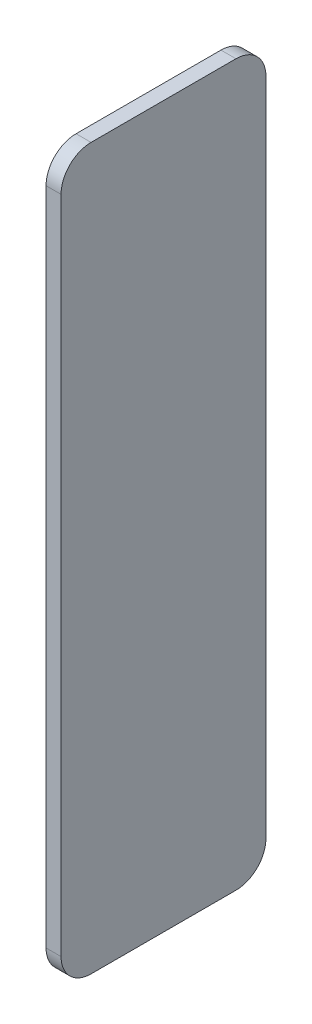
ISO-10303-21;
HEADER;
FILE_DESCRIPTION(('STEP AP214'),'2;1');
FILE_NAME('part.step','',(''),(''),'','','');
FILE_SCHEMA(('AUTOMOTIVE_DESIGN { 1 0 10303 214 1 1 1 1 }'));
ENDSEC;
DATA;
#1=APPLICATION_CONTEXT('core data for automotive mechanical design processes');
#2=APPLICATION_PROTOCOL_DEFINITION('international standard','automotive_design',2000,#1);
#3=PRODUCT_CONTEXT('',#1,'mechanical');
#4=PRODUCT('Part','Part','',(#3));
#5=PRODUCT_RELATED_PRODUCT_CATEGORY('part','',(#4));
#6=PRODUCT_DEFINITION_FORMATION('','',#4);
#7=PRODUCT_DEFINITION_CONTEXT('part definition',#1,'design');
#8=PRODUCT_DEFINITION('design','',#6,#7);
#9=PRODUCT_DEFINITION_SHAPE('','',#8);
#10=(LENGTH_UNIT() NAMED_UNIT(*) SI_UNIT(.MILLI.,.METRE.));
#11=(NAMED_UNIT(*) PLANE_ANGLE_UNIT() SI_UNIT($,.RADIAN.));
#12=(NAMED_UNIT(*) SI_UNIT($,.STERADIAN.) SOLID_ANGLE_UNIT());
#13=UNCERTAINTY_MEASURE_WITH_UNIT(LENGTH_MEASURE(1.E-05),#10,'distance_accuracy_value','');
#14=(GEOMETRIC_REPRESENTATION_CONTEXT(3) GLOBAL_UNCERTAINTY_ASSIGNED_CONTEXT((#13)) GLOBAL_UNIT_ASSIGNED_CONTEXT((#10,
#11,#12)) REPRESENTATION_CONTEXT('',''));
#15=CARTESIAN_POINT('',(0.,0.,0.));
#16=DIRECTION('',(0.,0.,1.));
#17=DIRECTION('',(1.,0.,0.));
#18=AXIS2_PLACEMENT_3D('',#15,#16,#17);
#19=CARTESIAN_POINT('',(-186.482668327185,108.771242076215,-91.0240564259798));
#20=DIRECTION('',(0.,0.,-1.));
#21=DIRECTION('',(-1.,0.,0.));
#22=AXIS2_PLACEMENT_3D('',#19,#20,#21);
#23=PLANE('',#22);
#24=DIRECTION('',(0.,-1.,0.));
#25=VECTOR('',#24,1.);
#26=CARTESIAN_POINT('',(-186.482668327185,108.771242076215,-91.0240564259798));
#27=LINE('',#26,#25);
#28=CARTESIAN_POINT('',(-186.482668327185,98.7712420762154,-91.0240564259798));
#29=VERTEX_POINT('',#28);
#30=CARTESIAN_POINT('',(-186.482668327185,-121.228757923785,-91.0240564259798));
#31=VERTEX_POINT('',#30);
#32=EDGE_CURVE('E157',#29,#31,#27,.T.);
#33=ORIENTED_EDGE('',*,*,#32,.T.);
#34=DIRECTION('',(-1.,0.,0.));
#35=VECTOR('',#34,1.);
#36=CARTESIAN_POINT('',(-186.482668327185,-121.228757923785,-91.0240564259798));
#37=LINE('',#36,#35);
#38=CARTESIAN_POINT('',(-191.482668327185,-121.228757923785,-91.0240564259798));
#39=VERTEX_POINT('',#38);
#40=EDGE_CURVE('E150',#31,#39,#37,.T.);
#41=ORIENTED_EDGE('',*,*,#40,.T.);
#42=DIRECTION('',(0.,-1.,0.));
#43=VECTOR('',#42,1.);
#44=CARTESIAN_POINT('',(-191.482668327185,108.771242076215,-91.0240564259798));
#45=LINE('',#44,#43);
#46=CARTESIAN_POINT('',(-191.482668327185,98.7712420762154,-91.0240564259798));
#47=VERTEX_POINT('',#46);
#48=EDGE_CURVE('E103',#47,#39,#45,.T.);
#49=ORIENTED_EDGE('',*,*,#48,.F.);
#50=DIRECTION('',(-1.,0.,0.));
#51=VECTOR('',#50,1.);
#52=CARTESIAN_POINT('',(-186.482668327185,98.7712420762154,-91.0240564259798));
#53=LINE('',#52,#51);
#54=EDGE_CURVE('E148',#47,#29,#53,.F.);
#55=ORIENTED_EDGE('',*,*,#54,.T.);
#56=EDGE_LOOP('',(#33,#41,#49,#55));
#57=FACE_BOUND('',#56,.T.);
#58=ADVANCED_FACE('F33',(#57),#23,.T.);
#59=CARTESIAN_POINT('',(-186.482668327185,108.771242076215,-91.0240564259798));
#60=DIRECTION('',(0.,1.,0.));
#61=DIRECTION('',(0.,0.,1.));
#62=AXIS2_PLACEMENT_3D('',#59,#60,#61);
#63=PLANE('',#62);
#64=DIRECTION('',(0.,0.,-1.));
#65=VECTOR('',#64,1.);
#66=CARTESIAN_POINT('',(-191.482668327185,108.771242076215,-91.0240564259798));
#67=LINE('',#66,#65);
#68=CARTESIAN_POINT('',(-191.482668327185,108.771242076215,-32.7384996739401));
#69=VERTEX_POINT('',#68);
#70=CARTESIAN_POINT('',(-191.482668327185,108.771242076215,-81.0240564259798));
#71=VERTEX_POINT('',#70);
#72=EDGE_CURVE('E131',#69,#71,#67,.T.);
#73=ORIENTED_EDGE('',*,*,#72,.F.);
#74=DIRECTION('',(-1.,0.,0.));
#75=VECTOR('',#74,1.);
#76=CARTESIAN_POINT('',(-186.482668327185,108.771242076215,-32.7384996739401));
#77=LINE('',#76,#75);
#78=CARTESIAN_POINT('',(-186.482668327185,108.771242076215,-32.7384996739401));
#79=VERTEX_POINT('',#78);
#80=EDGE_CURVE('E11',#69,#79,#77,.F.);
#81=ORIENTED_EDGE('',*,*,#80,.T.);
#82=DIRECTION('',(0.,0.,-1.));
#83=VECTOR('',#82,1.);
#84=CARTESIAN_POINT('',(-186.482668327185,108.771242076215,-91.0240564259798));
#85=LINE('',#84,#83);
#86=CARTESIAN_POINT('',(-186.482668327185,108.771242076215,-81.0240564259798));
#87=VERTEX_POINT('',#86);
#88=EDGE_CURVE('E124',#79,#87,#85,.T.);
#89=ORIENTED_EDGE('',*,*,#88,.T.);
#90=DIRECTION('',(-1.,0.,0.));
#91=VECTOR('',#90,1.);
#92=CARTESIAN_POINT('',(-186.482668327185,108.771242076215,-81.0240564259798));
#93=LINE('',#92,#91);
#94=EDGE_CURVE('E41',#87,#71,#93,.T.);
#95=ORIENTED_EDGE('',*,*,#94,.T.);
#96=EDGE_LOOP('',(#73,#81,#89,#95));
#97=FACE_BOUND('',#96,.T.);
#98=ADVANCED_FACE('F154',(#97),#63,.T.);
#99=CARTESIAN_POINT('',(-186.482668327185,108.771242076215,-22.7384996739401));
#100=DIRECTION('',(0.,0.,1.));
#101=DIRECTION('',(1.,0.,0.));
#102=AXIS2_PLACEMENT_3D('',#99,#100,#101);
#103=PLANE('',#102);
#104=DIRECTION('',(0.,1.,0.));
#105=VECTOR('',#104,1.);
#106=CARTESIAN_POINT('',(-191.482668327185,108.771242076215,-22.7384996739401));
#107=LINE('',#106,#105);
#108=CARTESIAN_POINT('',(-191.482668327185,-121.228757923785,-22.7384996739401));
#109=VERTEX_POINT('',#108);
#110=CARTESIAN_POINT('',(-191.482668327185,98.7712420762154,-22.7384996739401));
#111=VERTEX_POINT('',#110);
#112=EDGE_CURVE('E119',#109,#111,#107,.T.);
#113=ORIENTED_EDGE('',*,*,#112,.F.);
#114=DIRECTION('',(-1.,0.,0.));
#115=VECTOR('',#114,1.);
#116=CARTESIAN_POINT('',(-186.482668327185,-121.228757923785,-22.7384996739401));
#117=LINE('',#116,#115);
#118=CARTESIAN_POINT('',(-186.482668327185,-121.228757923785,-22.7384996739401));
#119=VERTEX_POINT('',#118);
#120=EDGE_CURVE('E140',#109,#119,#117,.F.);
#121=ORIENTED_EDGE('',*,*,#120,.T.);
#122=DIRECTION('',(0.,1.,0.));
#123=VECTOR('',#122,1.);
#124=CARTESIAN_POINT('',(-186.482668327185,108.771242076215,-22.7384996739401));
#125=LINE('',#124,#123);
#126=CARTESIAN_POINT('',(-186.482668327185,98.7712420762154,-22.7384996739401));
#127=VERTEX_POINT('',#126);
#128=EDGE_CURVE('E128',#119,#127,#125,.T.);
#129=ORIENTED_EDGE('',*,*,#128,.T.);
#130=DIRECTION('',(-1.,0.,0.));
#131=VECTOR('',#130,1.);
#132=CARTESIAN_POINT('',(-186.482668327185,98.7712420762154,-22.7384996739401));
#133=LINE('',#132,#131);
#134=EDGE_CURVE('E137',#127,#111,#133,.T.);
#135=ORIENTED_EDGE('',*,*,#134,.T.);
#136=EDGE_LOOP('',(#113,#121,#129,#135));
#137=FACE_BOUND('',#136,.T.);
#138=ADVANCED_FACE('F171',(#137),#103,.T.);
#139=CARTESIAN_POINT('',(-186.482668327185,-131.228757923785,-91.0240564259798));
#140=DIRECTION('',(0.,-1.,0.));
#141=DIRECTION('',(0.,0.,-1.));
#142=AXIS2_PLACEMENT_3D('',#139,#140,#141);
#143=PLANE('',#142);
#144=DIRECTION('',(0.,0.,1.));
#145=VECTOR('',#144,1.);
#146=CARTESIAN_POINT('',(-186.482668327185,-131.228757923785,-91.0240564259798));
#147=LINE('',#146,#145);
#148=CARTESIAN_POINT('',(-186.482668327185,-131.228757923785,-81.0240564259798));
#149=VERTEX_POINT('',#148);
#150=CARTESIAN_POINT('',(-186.482668327185,-131.228757923785,-32.7384996739401));
#151=VERTEX_POINT('',#150);
#152=EDGE_CURVE('E159',#149,#151,#147,.T.);
#153=ORIENTED_EDGE('',*,*,#152,.T.);
#154=DIRECTION('',(-1.,0.,0.));
#155=VECTOR('',#154,1.);
#156=CARTESIAN_POINT('',(-186.482668327185,-131.228757923785,-32.7384996739401));
#157=LINE('',#156,#155);
#158=CARTESIAN_POINT('',(-191.482668327185,-131.228757923785,-32.7384996739401));
#159=VERTEX_POINT('',#158);
#160=EDGE_CURVE('E118',#151,#159,#157,.T.);
#161=ORIENTED_EDGE('',*,*,#160,.T.);
#162=DIRECTION('',(0.,0.,1.));
#163=VECTOR('',#162,1.);
#164=CARTESIAN_POINT('',(-191.482668327185,-131.228757923785,-91.0240564259798));
#165=LINE('',#164,#163);
#166=CARTESIAN_POINT('',(-191.482668327185,-131.228757923785,-81.0240564259798));
#167=VERTEX_POINT('',#166);
#168=EDGE_CURVE('E101',#167,#159,#165,.T.);
#169=ORIENTED_EDGE('',*,*,#168,.F.);
#170=DIRECTION('',(-1.,0.,0.));
#171=VECTOR('',#170,1.);
#172=CARTESIAN_POINT('',(-186.482668327185,-131.228757923785,-81.0240564259798));
#173=LINE('',#172,#171);
#174=EDGE_CURVE('E115',#167,#149,#173,.F.);
#175=ORIENTED_EDGE('',*,*,#174,.T.);
#176=EDGE_LOOP('',(#153,#161,#169,#175));
#177=FACE_BOUND('',#176,.T.);
#178=ADVANCED_FACE('F114',(#177),#143,.T.);
#179=CARTESIAN_POINT('',(-186.482668327185,0.,0.));
#180=DIRECTION('',(-1.,0.,0.));
#181=DIRECTION('',(0.,0.,1.));
#182=AXIS2_PLACEMENT_3D('',#179,#180,#181);
#183=PLANE('',#182);
#184=ORIENTED_EDGE('',*,*,#128,.F.);
#185=CARTESIAN_POINT('',(-186.482668327185,-121.228757923785,-32.7384996739401));
#186=DIRECTION('',(-1.,0.,0.));
#187=DIRECTION('',(0.,0.,1.));
#188=AXIS2_PLACEMENT_3D('',#185,#186,#187);
#189=CIRCLE('',#188,10.);
#190=EDGE_CURVE('E146',#119,#151,#189,.F.);
#191=ORIENTED_EDGE('',*,*,#190,.T.);
#192=ORIENTED_EDGE('',*,*,#152,.F.);
#193=CARTESIAN_POINT('',(-186.482668327185,-121.228757923785,-81.0240564259798));
#194=DIRECTION('',(-1.,0.,0.));
#195=DIRECTION('',(0.,0.,1.));
#196=AXIS2_PLACEMENT_3D('',#193,#194,#195);
#197=CIRCLE('',#196,10.);
#198=EDGE_CURVE('E123',#149,#31,#197,.F.);
#199=ORIENTED_EDGE('',*,*,#198,.T.);
#200=ORIENTED_EDGE('',*,*,#32,.F.);
#201=CARTESIAN_POINT('',(-186.482668327185,98.7712420762154,-81.0240564259798));
#202=DIRECTION('',(-1.,0.,0.));
#203=DIRECTION('',(0.,0.,1.));
#204=AXIS2_PLACEMENT_3D('',#201,#202,#203);
#205=CIRCLE('',#204,10.);
#206=EDGE_CURVE('E48',#29,#87,#205,.F.);
#207=ORIENTED_EDGE('',*,*,#206,.T.);
#208=ORIENTED_EDGE('',*,*,#88,.F.);
#209=CARTESIAN_POINT('',(-186.482668327185,98.7712420762154,-32.7384996739401));
#210=DIRECTION('',(-1.,0.,0.));
#211=DIRECTION('',(0.,0.,1.));
#212=AXIS2_PLACEMENT_3D('',#209,#210,#211);
#213=CIRCLE('',#212,10.);
#214=EDGE_CURVE('E143',#79,#127,#213,.F.);
#215=ORIENTED_EDGE('',*,*,#214,.T.);
#216=EDGE_LOOP('',(#184,#191,#192,#199,#200,#207,#208,#215));
#217=FACE_BOUND('',#216,.T.);
#218=ADVANCED_FACE('F177',(#217),#183,.F.);
#219=CARTESIAN_POINT('',(-191.482668327185,0.,0.));
#220=DIRECTION('',(-1.,0.,0.));
#221=DIRECTION('',(0.,0.,1.));
#222=AXIS2_PLACEMENT_3D('',#219,#220,#221);
#223=PLANE('',#222);
#224=ORIENTED_EDGE('',*,*,#168,.T.);
#225=CARTESIAN_POINT('',(-191.482668327185,-121.228757923785,-32.7384996739401));
#226=DIRECTION('',(-1.,0.,0.));
#227=DIRECTION('',(0.,0.,1.));
#228=AXIS2_PLACEMENT_3D('',#225,#226,#227);
#229=CIRCLE('',#228,10.);
#230=EDGE_CURVE('E108',#159,#109,#229,.T.);
#231=ORIENTED_EDGE('',*,*,#230,.T.);
#232=ORIENTED_EDGE('',*,*,#112,.T.);
#233=CARTESIAN_POINT('',(-191.482668327185,98.7712420762154,-32.7384996739401));
#234=DIRECTION('',(-1.,0.,0.));
#235=DIRECTION('',(0.,0.,1.));
#236=AXIS2_PLACEMENT_3D('',#233,#234,#235);
#237=CIRCLE('',#236,10.);
#238=EDGE_CURVE('E109',#111,#69,#237,.T.);
#239=ORIENTED_EDGE('',*,*,#238,.T.);
#240=ORIENTED_EDGE('',*,*,#72,.T.);
#241=CARTESIAN_POINT('',(-191.482668327185,98.7712420762154,-81.0240564259798));
#242=DIRECTION('',(-1.,0.,0.));
#243=DIRECTION('',(0.,0.,1.));
#244=AXIS2_PLACEMENT_3D('',#241,#242,#243);
#245=CIRCLE('',#244,10.);
#246=EDGE_CURVE('E126',#71,#47,#245,.T.);
#247=ORIENTED_EDGE('',*,*,#246,.T.);
#248=ORIENTED_EDGE('',*,*,#48,.T.);
#249=CARTESIAN_POINT('',(-191.482668327185,-121.228757923785,-81.0240564259798));
#250=DIRECTION('',(-1.,0.,0.));
#251=DIRECTION('',(0.,0.,1.));
#252=AXIS2_PLACEMENT_3D('',#249,#250,#251);
#253=CIRCLE('',#252,10.);
#254=EDGE_CURVE('E98',#39,#167,#253,.T.);
#255=ORIENTED_EDGE('',*,*,#254,.T.);
#256=EDGE_LOOP('',(#224,#231,#232,#239,#240,#247,#248,#255));
#257=FACE_BOUND('',#256,.T.);
#258=ADVANCED_FACE('F100',(#257),#223,.T.);
#259=CARTESIAN_POINT('',(-186.482668327185,-121.228757923785,-32.7384996739401));
#260=DIRECTION('',(-1.,0.,0.));
#261=DIRECTION('',(0.,0.,1.));
#262=AXIS2_PLACEMENT_3D('',#259,#260,#261);
#263=CYLINDRICAL_SURFACE('',#262,10.);
#264=ORIENTED_EDGE('',*,*,#190,.F.);
#265=ORIENTED_EDGE('',*,*,#120,.F.);
#266=ORIENTED_EDGE('',*,*,#230,.F.);
#267=ORIENTED_EDGE('',*,*,#160,.F.);
#268=EDGE_LOOP('',(#264,#265,#266,#267));
#269=FACE_BOUND('',#268,.T.);
#270=ADVANCED_FACE('F168',(#269),#263,.T.);
#271=CARTESIAN_POINT('',(-186.482668327185,-121.228757923785,-81.0240564259798));
#272=DIRECTION('',(-1.,0.,0.));
#273=DIRECTION('',(0.,0.,1.));
#274=AXIS2_PLACEMENT_3D('',#271,#272,#273);
#275=CYLINDRICAL_SURFACE('',#274,10.);
#276=ORIENTED_EDGE('',*,*,#198,.F.);
#277=ORIENTED_EDGE('',*,*,#174,.F.);
#278=ORIENTED_EDGE('',*,*,#254,.F.);
#279=ORIENTED_EDGE('',*,*,#40,.F.);
#280=EDGE_LOOP('',(#276,#277,#278,#279));
#281=FACE_BOUND('',#280,.T.);
#282=ADVANCED_FACE('F122',(#281),#275,.T.);
#283=CARTESIAN_POINT('',(-186.482668327185,98.7712420762154,-32.7384996739401));
#284=DIRECTION('',(-1.,0.,0.));
#285=DIRECTION('',(0.,0.,1.));
#286=AXIS2_PLACEMENT_3D('',#283,#284,#285);
#287=CYLINDRICAL_SURFACE('',#286,10.);
#288=ORIENTED_EDGE('',*,*,#214,.F.);
#289=ORIENTED_EDGE('',*,*,#80,.F.);
#290=ORIENTED_EDGE('',*,*,#238,.F.);
#291=ORIENTED_EDGE('',*,*,#134,.F.);
#292=EDGE_LOOP('',(#288,#289,#290,#291));
#293=FACE_BOUND('',#292,.T.);
#294=ADVANCED_FACE('F176',(#293),#287,.T.);
#295=CARTESIAN_POINT('',(-186.482668327185,98.7712420762154,-81.0240564259798));
#296=DIRECTION('',(-1.,0.,0.));
#297=DIRECTION('',(0.,0.,1.));
#298=AXIS2_PLACEMENT_3D('',#295,#296,#297);
#299=CYLINDRICAL_SURFACE('',#298,10.);
#300=ORIENTED_EDGE('',*,*,#206,.F.);
#301=ORIENTED_EDGE('',*,*,#54,.F.);
#302=ORIENTED_EDGE('',*,*,#246,.F.);
#303=ORIENTED_EDGE('',*,*,#94,.F.);
#304=EDGE_LOOP('',(#300,#301,#302,#303));
#305=FACE_BOUND('',#304,.T.);
#306=ADVANCED_FACE('F35',(#305),#299,.T.);
#307=CLOSED_SHELL('',(#58,#98,#138,#178,#218,#258,#270,#282,#294,#306));
#308=MANIFOLD_SOLID_BREP('B2',#307);
#309=ADVANCED_BREP_SHAPE_REPRESENTATION('',(#18,#308),#14);
#310=SHAPE_DEFINITION_REPRESENTATION(#9,#309);
ENDSEC;
END-ISO-10303-21;
